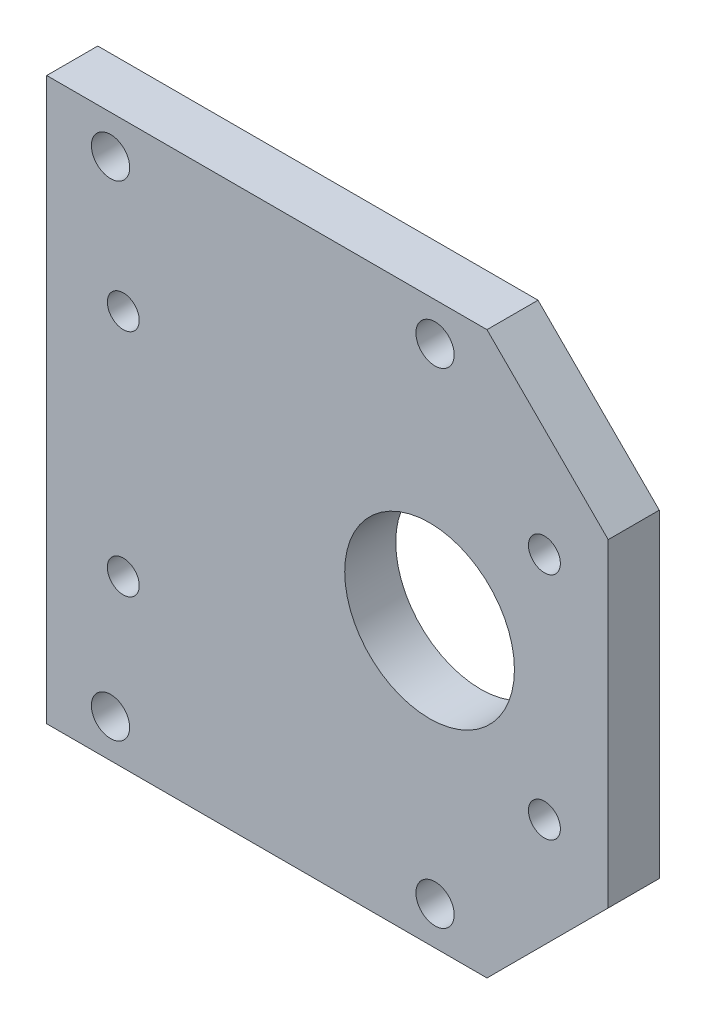
ISO-10303-21;
HEADER;
FILE_DESCRIPTION(('STEP AP214'),'2;1');
FILE_NAME('part.step','',(''),(''),'','','');
FILE_SCHEMA(('AUTOMOTIVE_DESIGN { 1 0 10303 214 1 1 1 1 }'));
ENDSEC;
DATA;
#1=APPLICATION_CONTEXT('core data for automotive mechanical design processes');
#2=APPLICATION_PROTOCOL_DEFINITION('international standard','automotive_design',2000,#1);
#3=PRODUCT_CONTEXT('',#1,'mechanical');
#4=PRODUCT('Part','Part','',(#3));
#5=PRODUCT_RELATED_PRODUCT_CATEGORY('part','',(#4));
#6=PRODUCT_DEFINITION_FORMATION('','',#4);
#7=PRODUCT_DEFINITION_CONTEXT('part definition',#1,'design');
#8=PRODUCT_DEFINITION('design','',#6,#7);
#9=PRODUCT_DEFINITION_SHAPE('','',#8);
#10=(LENGTH_UNIT() NAMED_UNIT(*) SI_UNIT(.MILLI.,.METRE.));
#11=(NAMED_UNIT(*) PLANE_ANGLE_UNIT() SI_UNIT($,.RADIAN.));
#12=(NAMED_UNIT(*) SI_UNIT($,.STERADIAN.) SOLID_ANGLE_UNIT());
#13=UNCERTAINTY_MEASURE_WITH_UNIT(LENGTH_MEASURE(1.E-05),#10,'distance_accuracy_value','');
#14=(GEOMETRIC_REPRESENTATION_CONTEXT(3) GLOBAL_UNCERTAINTY_ASSIGNED_CONTEXT((#13)) GLOBAL_UNIT_ASSIGNED_CONTEXT((#10,
#11,#12)) REPRESENTATION_CONTEXT('',''));
#15=CARTESIAN_POINT('',(0.,0.,0.));
#16=DIRECTION('',(0.,0.,1.));
#17=DIRECTION('',(1.,0.,0.));
#18=AXIS2_PLACEMENT_3D('',#15,#16,#17);
#19=CARTESIAN_POINT('',(0.,0.,4.));
#20=DIRECTION('',(0.,0.,-1.));
#21=DIRECTION('',(-1.,0.,0.));
#22=AXIS2_PLACEMENT_3D('',#19,#20,#21);
#23=PLANE('',#22);
#24=CARTESIAN_POINT('',(8.42893218813452,19.,4.));
#25=DIRECTION('',(0.,0.,1.));
#26=DIRECTION('',(-1.,0.,0.));
#27=AXIS2_PLACEMENT_3D('',#24,#25,#26);
#28=CIRCLE('',#27,1.5);
#29=CARTESIAN_POINT('',(6.92893218813451,19.,4.));
#30=VERTEX_POINT('',#29);
#31=EDGE_CURVE('E202',#30,#30,#28,.T.);
#32=ORIENTED_EDGE('',*,*,#31,.F.);
#33=EDGE_LOOP('',(#32));
#34=FACE_BOUND('',#33,.T.);
#35=CARTESIAN_POINT('',(-17.,19.,4.));
#36=DIRECTION('',(0.,0.,1.));
#37=DIRECTION('',(-1.,0.,0.));
#38=AXIS2_PLACEMENT_3D('',#35,#36,#37);
#39=CIRCLE('',#38,1.5);
#40=CARTESIAN_POINT('',(-18.5,19.,4.));
#41=VERTEX_POINT('',#40);
#42=EDGE_CURVE('E204',#41,#41,#39,.T.);
#43=ORIENTED_EDGE('',*,*,#42,.F.);
#44=EDGE_LOOP('',(#43));
#45=FACE_BOUND('',#44,.T.);
#46=CARTESIAN_POINT('',(8.42893218813452,-19.,4.));
#47=DIRECTION('',(0.,0.,1.));
#48=DIRECTION('',(1.,0.,0.));
#49=AXIS2_PLACEMENT_3D('',#46,#47,#48);
#50=CIRCLE('',#49,1.5);
#51=CARTESIAN_POINT('',(9.92893218813452,-19.,4.));
#52=VERTEX_POINT('',#51);
#53=EDGE_CURVE('E210',#52,#52,#50,.T.);
#54=ORIENTED_EDGE('',*,*,#53,.F.);
#55=EDGE_LOOP('',(#54));
#56=FACE_BOUND('',#55,.T.);
#57=CARTESIAN_POINT('',(-17.,-19.,4.));
#58=DIRECTION('',(0.,0.,1.));
#59=DIRECTION('',(1.,0.,0.));
#60=AXIS2_PLACEMENT_3D('',#57,#58,#59);
#61=CIRCLE('',#60,1.5);
#62=CARTESIAN_POINT('',(-15.5,-19.,4.));
#63=VERTEX_POINT('',#62);
#64=EDGE_CURVE('E216',#63,#63,#61,.T.);
#65=ORIENTED_EDGE('',*,*,#64,.F.);
#66=EDGE_LOOP('',(#65));
#67=FACE_BOUND('',#66,.T.);
#68=DIRECTION('',(-0.707106781186549,0.707106781186546,0.));
#69=VECTOR('',#68,1.);
#70=CARTESIAN_POINT('',(12.5,22.,4.));
#71=LINE('',#70,#69);
#72=CARTESIAN_POINT('',(22.,12.5,4.));
#73=VERTEX_POINT('',#72);
#74=CARTESIAN_POINT('',(12.5,22.,4.));
#75=VERTEX_POINT('',#74);
#76=EDGE_CURVE('E128',#73,#75,#71,.T.);
#77=ORIENTED_EDGE('',*,*,#76,.T.);
#78=DIRECTION('',(-1.,0.,0.));
#79=VECTOR('',#78,1.);
#80=CARTESIAN_POINT('',(-22.,22.,4.));
#81=LINE('',#80,#79);
#82=CARTESIAN_POINT('',(-22.,22.,4.));
#83=VERTEX_POINT('',#82);
#84=EDGE_CURVE('E86',#75,#83,#81,.T.);
#85=ORIENTED_EDGE('',*,*,#84,.T.);
#86=DIRECTION('',(0.,-1.,0.));
#87=VECTOR('',#86,1.);
#88=CARTESIAN_POINT('',(-22.,-22.,4.));
#89=LINE('',#88,#87);
#90=CARTESIAN_POINT('',(-22.,-22.,4.));
#91=VERTEX_POINT('',#90);
#92=EDGE_CURVE('E99',#83,#91,#89,.T.);
#93=ORIENTED_EDGE('',*,*,#92,.T.);
#94=DIRECTION('',(1.,0.,0.));
#95=VECTOR('',#94,1.);
#96=CARTESIAN_POINT('',(12.5,-22.,4.));
#97=LINE('',#96,#95);
#98=CARTESIAN_POINT('',(12.5,-22.,4.));
#99=VERTEX_POINT('',#98);
#100=EDGE_CURVE('E93',#91,#99,#97,.T.);
#101=ORIENTED_EDGE('',*,*,#100,.T.);
#102=DIRECTION('',(0.707106781186549,0.707106781186546,0.));
#103=VECTOR('',#102,1.);
#104=CARTESIAN_POINT('',(22.,-12.5,4.));
#105=LINE('',#104,#103);
#106=CARTESIAN_POINT('',(22.,-12.5,4.));
#107=VERTEX_POINT('',#106);
#108=EDGE_CURVE('E97',#99,#107,#105,.T.);
#109=ORIENTED_EDGE('',*,*,#108,.T.);
#110=DIRECTION('',(0.,1.,0.));
#111=VECTOR('',#110,1.);
#112=CARTESIAN_POINT('',(22.,12.5,4.));
#113=LINE('',#112,#111);
#114=EDGE_CURVE('E49',#107,#73,#113,.T.);
#115=ORIENTED_EDGE('',*,*,#114,.T.);
#116=EDGE_LOOP('',(#77,#85,#93,#101,#109,#115));
#117=FACE_BOUND('',#116,.T.);
#118=CARTESIAN_POINT('',(8.00000000000001,0.,4.));
#119=DIRECTION('',(0.,0.,1.));
#120=DIRECTION('',(1.,0.,0.));
#121=AXIS2_PLACEMENT_3D('',#118,#119,#120);
#122=CIRCLE('',#121,6.65);
#123=CARTESIAN_POINT('',(14.65,0.,4.));
#124=VERTEX_POINT('',#123);
#125=EDGE_CURVE('E121',#124,#124,#122,.T.);
#126=ORIENTED_EDGE('',*,*,#125,.F.);
#127=EDGE_LOOP('',(#126));
#128=FACE_BOUND('',#127,.T.);
#129=CARTESIAN_POINT('',(17.,9.,4.));
#130=DIRECTION('',(0.,0.,1.));
#131=DIRECTION('',(1.,0.,0.));
#132=AXIS2_PLACEMENT_3D('',#129,#130,#131);
#133=CIRCLE('',#132,1.25);
#134=CARTESIAN_POINT('',(18.25,9.,4.));
#135=VERTEX_POINT('',#134);
#136=EDGE_CURVE('E243',#135,#135,#133,.T.);
#137=ORIENTED_EDGE('',*,*,#136,.F.);
#138=EDGE_LOOP('',(#137));
#139=FACE_BOUND('',#138,.T.);
#140=CARTESIAN_POINT('',(17.,-9.,4.));
#141=DIRECTION('',(0.,0.,1.));
#142=DIRECTION('',(1.,0.,0.));
#143=AXIS2_PLACEMENT_3D('',#140,#141,#142);
#144=CIRCLE('',#143,1.25);
#145=CARTESIAN_POINT('',(18.25,-9.,4.));
#146=VERTEX_POINT('',#145);
#147=EDGE_CURVE('E237',#146,#146,#144,.T.);
#148=ORIENTED_EDGE('',*,*,#147,.F.);
#149=EDGE_LOOP('',(#148));
#150=FACE_BOUND('',#149,.T.);
#151=CARTESIAN_POINT('',(-16.,9.00000000000001,4.));
#152=DIRECTION('',(0.,0.,1.));
#153=DIRECTION('',(1.,0.,0.));
#154=AXIS2_PLACEMENT_3D('',#151,#152,#153);
#155=CIRCLE('',#154,1.25);
#156=CARTESIAN_POINT('',(-14.75,9.00000000000001,4.));
#157=VERTEX_POINT('',#156);
#158=EDGE_CURVE('E231',#157,#157,#155,.T.);
#159=ORIENTED_EDGE('',*,*,#158,.F.);
#160=EDGE_LOOP('',(#159));
#161=FACE_BOUND('',#160,.T.);
#162=CARTESIAN_POINT('',(-16.,-9.,4.));
#163=DIRECTION('',(0.,0.,1.));
#164=DIRECTION('',(1.,0.,0.));
#165=AXIS2_PLACEMENT_3D('',#162,#163,#164);
#166=CIRCLE('',#165,1.25);
#167=CARTESIAN_POINT('',(-14.75,-9.,4.));
#168=VERTEX_POINT('',#167);
#169=EDGE_CURVE('E225',#168,#168,#166,.T.);
#170=ORIENTED_EDGE('',*,*,#169,.F.);
#171=EDGE_LOOP('',(#170));
#172=FACE_BOUND('',#171,.T.);
#173=ADVANCED_FACE('F32',(#34,#45,#56,#67,#117,#128,#139,#150,#161,#172),#23,.F.);
#174=CARTESIAN_POINT('',(0.,0.,0.));
#175=DIRECTION('',(0.,0.,-1.));
#176=DIRECTION('',(-1.,0.,0.));
#177=AXIS2_PLACEMENT_3D('',#174,#175,#176);
#178=PLANE('',#177);
#179=CARTESIAN_POINT('',(8.42893218813452,19.,0.));
#180=DIRECTION('',(0.,0.,1.));
#181=DIRECTION('',(-1.,0.,0.));
#182=AXIS2_PLACEMENT_3D('',#179,#180,#181);
#183=CIRCLE('',#182,1.5);
#184=CARTESIAN_POINT('',(6.92893218813451,19.,0.));
#185=VERTEX_POINT('',#184);
#186=EDGE_CURVE('E200',#185,#185,#183,.T.);
#187=ORIENTED_EDGE('',*,*,#186,.T.);
#188=EDGE_LOOP('',(#187));
#189=FACE_BOUND('',#188,.T.);
#190=CARTESIAN_POINT('',(-17.,19.,0.));
#191=DIRECTION('',(0.,0.,1.));
#192=DIRECTION('',(-1.,0.,0.));
#193=AXIS2_PLACEMENT_3D('',#190,#191,#192);
#194=CIRCLE('',#193,1.5);
#195=CARTESIAN_POINT('',(-18.5,19.,0.));
#196=VERTEX_POINT('',#195);
#197=EDGE_CURVE('E207',#196,#196,#194,.T.);
#198=ORIENTED_EDGE('',*,*,#197,.T.);
#199=EDGE_LOOP('',(#198));
#200=FACE_BOUND('',#199,.T.);
#201=CARTESIAN_POINT('',(8.42893218813452,-19.,0.));
#202=DIRECTION('',(0.,0.,1.));
#203=DIRECTION('',(1.,0.,0.));
#204=AXIS2_PLACEMENT_3D('',#201,#202,#203);
#205=CIRCLE('',#204,1.5);
#206=CARTESIAN_POINT('',(9.92893218813452,-19.,0.));
#207=VERTEX_POINT('',#206);
#208=EDGE_CURVE('E213',#207,#207,#205,.T.);
#209=ORIENTED_EDGE('',*,*,#208,.T.);
#210=EDGE_LOOP('',(#209));
#211=FACE_BOUND('',#210,.T.);
#212=CARTESIAN_POINT('',(-17.,-19.,0.));
#213=DIRECTION('',(0.,0.,1.));
#214=DIRECTION('',(1.,0.,0.));
#215=AXIS2_PLACEMENT_3D('',#212,#213,#214);
#216=CIRCLE('',#215,1.5);
#217=CARTESIAN_POINT('',(-15.5,-19.,0.));
#218=VERTEX_POINT('',#217);
#219=EDGE_CURVE('E219',#218,#218,#216,.T.);
#220=ORIENTED_EDGE('',*,*,#219,.T.);
#221=EDGE_LOOP('',(#220));
#222=FACE_BOUND('',#221,.T.);
#223=CARTESIAN_POINT('',(-16.,9.00000000000001,0.));
#224=DIRECTION('',(0.,0.,1.));
#225=DIRECTION('',(1.,0.,0.));
#226=AXIS2_PLACEMENT_3D('',#223,#224,#225);
#227=CIRCLE('',#226,1.25);
#228=CARTESIAN_POINT('',(-14.75,9.00000000000001,0.));
#229=VERTEX_POINT('',#228);
#230=EDGE_CURVE('E228',#229,#229,#227,.T.);
#231=ORIENTED_EDGE('',*,*,#230,.T.);
#232=EDGE_LOOP('',(#231));
#233=FACE_BOUND('',#232,.T.);
#234=CARTESIAN_POINT('',(17.,9.,0.));
#235=DIRECTION('',(0.,0.,1.));
#236=DIRECTION('',(1.,0.,0.));
#237=AXIS2_PLACEMENT_3D('',#234,#235,#236);
#238=CIRCLE('',#237,1.25);
#239=CARTESIAN_POINT('',(18.25,9.,0.));
#240=VERTEX_POINT('',#239);
#241=EDGE_CURVE('E240',#240,#240,#238,.T.);
#242=ORIENTED_EDGE('',*,*,#241,.T.);
#243=EDGE_LOOP('',(#242));
#244=FACE_BOUND('',#243,.T.);
#245=DIRECTION('',(-0.707106781186549,0.707106781186546,0.));
#246=VECTOR('',#245,1.);
#247=CARTESIAN_POINT('',(12.5,22.,0.));
#248=LINE('',#247,#246);
#249=CARTESIAN_POINT('',(22.,12.5,0.));
#250=VERTEX_POINT('',#249);
#251=CARTESIAN_POINT('',(12.5,22.,0.));
#252=VERTEX_POINT('',#251);
#253=EDGE_CURVE('E117',#250,#252,#248,.T.);
#254=ORIENTED_EDGE('',*,*,#253,.F.);
#255=DIRECTION('',(0.,1.,0.));
#256=VECTOR('',#255,1.);
#257=CARTESIAN_POINT('',(22.,12.5,0.));
#258=LINE('',#257,#256);
#259=CARTESIAN_POINT('',(22.,-12.5,0.));
#260=VERTEX_POINT('',#259);
#261=EDGE_CURVE('E78',#260,#250,#258,.T.);
#262=ORIENTED_EDGE('',*,*,#261,.F.);
#263=DIRECTION('',(0.707106781186549,0.707106781186546,0.));
#264=VECTOR('',#263,1.);
#265=CARTESIAN_POINT('',(22.,-12.5,0.));
#266=LINE('',#265,#264);
#267=CARTESIAN_POINT('',(12.5,-22.,0.));
#268=VERTEX_POINT('',#267);
#269=EDGE_CURVE('E72',#268,#260,#266,.T.);
#270=ORIENTED_EDGE('',*,*,#269,.F.);
#271=DIRECTION('',(1.,0.,0.));
#272=VECTOR('',#271,1.);
#273=CARTESIAN_POINT('',(12.5,-22.,0.));
#274=LINE('',#273,#272);
#275=CARTESIAN_POINT('',(-22.,-22.,0.));
#276=VERTEX_POINT('',#275);
#277=EDGE_CURVE('E107',#276,#268,#274,.T.);
#278=ORIENTED_EDGE('',*,*,#277,.F.);
#279=DIRECTION('',(0.,-1.,0.));
#280=VECTOR('',#279,1.);
#281=CARTESIAN_POINT('',(-22.,-22.,0.));
#282=LINE('',#281,#280);
#283=CARTESIAN_POINT('',(-22.,22.,0.));
#284=VERTEX_POINT('',#283);
#285=EDGE_CURVE('E123',#284,#276,#282,.T.);
#286=ORIENTED_EDGE('',*,*,#285,.F.);
#287=DIRECTION('',(-1.,0.,0.));
#288=VECTOR('',#287,1.);
#289=CARTESIAN_POINT('',(-22.,22.,0.));
#290=LINE('',#289,#288);
#291=EDGE_CURVE('E120',#252,#284,#290,.T.);
#292=ORIENTED_EDGE('',*,*,#291,.F.);
#293=EDGE_LOOP('',(#254,#262,#270,#278,#286,#292));
#294=FACE_BOUND('',#293,.T.);
#295=CARTESIAN_POINT('',(8.00000000000001,0.,0.));
#296=DIRECTION('',(0.,0.,1.));
#297=DIRECTION('',(1.,0.,0.));
#298=AXIS2_PLACEMENT_3D('',#295,#296,#297);
#299=CIRCLE('',#298,6.65);
#300=CARTESIAN_POINT('',(14.65,0.,0.));
#301=VERTEX_POINT('',#300);
#302=EDGE_CURVE('E246',#301,#301,#299,.T.);
#303=ORIENTED_EDGE('',*,*,#302,.T.);
#304=EDGE_LOOP('',(#303));
#305=FACE_BOUND('',#304,.T.);
#306=CARTESIAN_POINT('',(17.,-9.,0.));
#307=DIRECTION('',(0.,0.,1.));
#308=DIRECTION('',(1.,0.,0.));
#309=AXIS2_PLACEMENT_3D('',#306,#307,#308);
#310=CIRCLE('',#309,1.25);
#311=CARTESIAN_POINT('',(18.25,-9.,0.));
#312=VERTEX_POINT('',#311);
#313=EDGE_CURVE('E234',#312,#312,#310,.T.);
#314=ORIENTED_EDGE('',*,*,#313,.T.);
#315=EDGE_LOOP('',(#314));
#316=FACE_BOUND('',#315,.T.);
#317=CARTESIAN_POINT('',(-16.,-9.,0.));
#318=DIRECTION('',(0.,0.,1.));
#319=DIRECTION('',(1.,0.,0.));
#320=AXIS2_PLACEMENT_3D('',#317,#318,#319);
#321=CIRCLE('',#320,1.25);
#322=CARTESIAN_POINT('',(-14.75,-9.,0.));
#323=VERTEX_POINT('',#322);
#324=EDGE_CURVE('E222',#323,#323,#321,.T.);
#325=ORIENTED_EDGE('',*,*,#324,.T.);
#326=EDGE_LOOP('',(#325));
#327=FACE_BOUND('',#326,.T.);
#328=ADVANCED_FACE('F137',(#189,#200,#211,#222,#233,#244,#294,#305,#316,#327),#178,.T.);
#329=CARTESIAN_POINT('',(12.5,22.,4.));
#330=DIRECTION('',(-0.707106781186546,-0.707106781186549,0.));
#331=DIRECTION('',(0.707106781186549,-0.707106781186546,0.));
#332=AXIS2_PLACEMENT_3D('',#329,#330,#331);
#333=PLANE('',#332);
#334=ORIENTED_EDGE('',*,*,#253,.T.);
#335=DIRECTION('',(0.,0.,-1.));
#336=VECTOR('',#335,1.);
#337=CARTESIAN_POINT('',(12.5,22.,4.));
#338=LINE('',#337,#336);
#339=EDGE_CURVE('E11',#75,#252,#338,.T.);
#340=ORIENTED_EDGE('',*,*,#339,.F.);
#341=ORIENTED_EDGE('',*,*,#76,.F.);
#342=DIRECTION('',(0.,0.,-1.));
#343=VECTOR('',#342,1.);
#344=CARTESIAN_POINT('',(22.,12.5,4.));
#345=LINE('',#344,#343);
#346=EDGE_CURVE('E113',#73,#250,#345,.T.);
#347=ORIENTED_EDGE('',*,*,#346,.T.);
#348=EDGE_LOOP('',(#334,#340,#341,#347));
#349=FACE_BOUND('',#348,.T.);
#350=ADVANCED_FACE('F34',(#349),#333,.F.);
#351=CARTESIAN_POINT('',(-22.,22.,4.));
#352=DIRECTION('',(0.,-1.,0.));
#353=DIRECTION('',(0.,0.,-1.));
#354=AXIS2_PLACEMENT_3D('',#351,#352,#353);
#355=PLANE('',#354);
#356=ORIENTED_EDGE('',*,*,#291,.T.);
#357=DIRECTION('',(0.,0.,-1.));
#358=VECTOR('',#357,1.);
#359=CARTESIAN_POINT('',(-22.,22.,4.));
#360=LINE('',#359,#358);
#361=EDGE_CURVE('E41',#83,#284,#360,.T.);
#362=ORIENTED_EDGE('',*,*,#361,.F.);
#363=ORIENTED_EDGE('',*,*,#84,.F.);
#364=ORIENTED_EDGE('',*,*,#339,.T.);
#365=EDGE_LOOP('',(#356,#362,#363,#364));
#366=FACE_BOUND('',#365,.T.);
#367=ADVANCED_FACE('F351',(#366),#355,.F.);
#368=CARTESIAN_POINT('',(-22.,-22.,4.));
#369=DIRECTION('',(1.,0.,0.));
#370=DIRECTION('',(0.,0.,-1.));
#371=AXIS2_PLACEMENT_3D('',#368,#369,#370);
#372=PLANE('',#371);
#373=ORIENTED_EDGE('',*,*,#285,.T.);
#374=DIRECTION('',(0.,0.,-1.));
#375=VECTOR('',#374,1.);
#376=CARTESIAN_POINT('',(-22.,-22.,4.));
#377=LINE('',#376,#375);
#378=EDGE_CURVE('E108',#91,#276,#377,.T.);
#379=ORIENTED_EDGE('',*,*,#378,.F.);
#380=ORIENTED_EDGE('',*,*,#92,.F.);
#381=ORIENTED_EDGE('',*,*,#361,.T.);
#382=EDGE_LOOP('',(#373,#379,#380,#381));
#383=FACE_BOUND('',#382,.T.);
#384=ADVANCED_FACE('F134',(#383),#372,.F.);
#385=CARTESIAN_POINT('',(12.5,-22.,4.));
#386=DIRECTION('',(0.,1.,0.));
#387=DIRECTION('',(-1.,0.,0.));
#388=AXIS2_PLACEMENT_3D('',#385,#386,#387);
#389=PLANE('',#388);
#390=ORIENTED_EDGE('',*,*,#277,.T.);
#391=DIRECTION('',(0.,0.,-1.));
#392=VECTOR('',#391,1.);
#393=CARTESIAN_POINT('',(12.5,-22.,4.));
#394=LINE('',#393,#392);
#395=EDGE_CURVE('E104',#99,#268,#394,.T.);
#396=ORIENTED_EDGE('',*,*,#395,.F.);
#397=ORIENTED_EDGE('',*,*,#100,.F.);
#398=ORIENTED_EDGE('',*,*,#378,.T.);
#399=EDGE_LOOP('',(#390,#396,#397,#398));
#400=FACE_BOUND('',#399,.T.);
#401=ADVANCED_FACE('F105',(#400),#389,.F.);
#402=CARTESIAN_POINT('',(22.,-12.5,4.));
#403=DIRECTION('',(-0.707106781186546,0.707106781186549,0.));
#404=DIRECTION('',(-0.707106781186549,-0.707106781186546,0.));
#405=AXIS2_PLACEMENT_3D('',#402,#403,#404);
#406=PLANE('',#405);
#407=ORIENTED_EDGE('',*,*,#269,.T.);
#408=DIRECTION('',(0.,0.,-1.));
#409=VECTOR('',#408,1.);
#410=CARTESIAN_POINT('',(22.,-12.5,4.));
#411=LINE('',#410,#409);
#412=EDGE_CURVE('E109',#107,#260,#411,.T.);
#413=ORIENTED_EDGE('',*,*,#412,.F.);
#414=ORIENTED_EDGE('',*,*,#108,.F.);
#415=ORIENTED_EDGE('',*,*,#395,.T.);
#416=EDGE_LOOP('',(#407,#413,#414,#415));
#417=FACE_BOUND('',#416,.T.);
#418=ADVANCED_FACE('F111',(#417),#406,.F.);
#419=CARTESIAN_POINT('',(22.,12.5,4.));
#420=DIRECTION('',(-1.,0.,0.));
#421=DIRECTION('',(0.,0.,1.));
#422=AXIS2_PLACEMENT_3D('',#419,#420,#421);
#423=PLANE('',#422);
#424=ORIENTED_EDGE('',*,*,#261,.T.);
#425=ORIENTED_EDGE('',*,*,#346,.F.);
#426=ORIENTED_EDGE('',*,*,#114,.F.);
#427=ORIENTED_EDGE('',*,*,#412,.T.);
#428=EDGE_LOOP('',(#424,#425,#426,#427));
#429=FACE_BOUND('',#428,.T.);
#430=ADVANCED_FACE('F142',(#429),#423,.F.);
#431=CARTESIAN_POINT('',(8.00000000000001,0.,4.));
#432=DIRECTION('',(0.,0.,-1.));
#433=DIRECTION('',(-1.,0.,0.));
#434=AXIS2_PLACEMENT_3D('',#431,#432,#433);
#435=CYLINDRICAL_SURFACE('',#434,6.65);
#436=ORIENTED_EDGE('',*,*,#125,.T.);
#437=EDGE_LOOP('',(#436));
#438=FACE_BOUND('',#437,.T.);
#439=ORIENTED_EDGE('',*,*,#302,.F.);
#440=EDGE_LOOP('',(#439));
#441=FACE_BOUND('',#440,.T.);
#442=ADVANCED_FACE('F144',(#438,#441),#435,.F.);
#443=CARTESIAN_POINT('',(17.,9.,4.));
#444=DIRECTION('',(0.,0.,-1.));
#445=DIRECTION('',(-1.,0.,0.));
#446=AXIS2_PLACEMENT_3D('',#443,#444,#445);
#447=CYLINDRICAL_SURFACE('',#446,1.25);
#448=ORIENTED_EDGE('',*,*,#136,.T.);
#449=EDGE_LOOP('',(#448));
#450=FACE_BOUND('',#449,.T.);
#451=ORIENTED_EDGE('',*,*,#241,.F.);
#452=EDGE_LOOP('',(#451));
#453=FACE_BOUND('',#452,.T.);
#454=ADVANCED_FACE('F150',(#450,#453),#447,.F.);
#455=CARTESIAN_POINT('',(17.,-9.,4.));
#456=DIRECTION('',(0.,0.,-1.));
#457=DIRECTION('',(-1.,0.,0.));
#458=AXIS2_PLACEMENT_3D('',#455,#456,#457);
#459=CYLINDRICAL_SURFACE('',#458,1.25);
#460=ORIENTED_EDGE('',*,*,#147,.T.);
#461=EDGE_LOOP('',(#460));
#462=FACE_BOUND('',#461,.T.);
#463=ORIENTED_EDGE('',*,*,#313,.F.);
#464=EDGE_LOOP('',(#463));
#465=FACE_BOUND('',#464,.T.);
#466=ADVANCED_FACE('F167',(#462,#465),#459,.F.);
#467=CARTESIAN_POINT('',(-16.,9.00000000000001,4.));
#468=DIRECTION('',(0.,0.,-1.));
#469=DIRECTION('',(-1.,0.,0.));
#470=AXIS2_PLACEMENT_3D('',#467,#468,#469);
#471=CYLINDRICAL_SURFACE('',#470,1.25);
#472=ORIENTED_EDGE('',*,*,#158,.T.);
#473=EDGE_LOOP('',(#472));
#474=FACE_BOUND('',#473,.T.);
#475=ORIENTED_EDGE('',*,*,#230,.F.);
#476=EDGE_LOOP('',(#475));
#477=FACE_BOUND('',#476,.T.);
#478=ADVANCED_FACE('F171',(#474,#477),#471,.F.);
#479=CARTESIAN_POINT('',(-16.,-9.,4.));
#480=DIRECTION('',(0.,0.,-1.));
#481=DIRECTION('',(-1.,0.,0.));
#482=AXIS2_PLACEMENT_3D('',#479,#480,#481);
#483=CYLINDRICAL_SURFACE('',#482,1.25);
#484=ORIENTED_EDGE('',*,*,#169,.T.);
#485=EDGE_LOOP('',(#484));
#486=FACE_BOUND('',#485,.T.);
#487=ORIENTED_EDGE('',*,*,#324,.F.);
#488=EDGE_LOOP('',(#487));
#489=FACE_BOUND('',#488,.T.);
#490=ADVANCED_FACE('F175',(#486,#489),#483,.F.);
#491=CARTESIAN_POINT('',(-17.,-19.,0.));
#492=DIRECTION('',(0.,0.,1.));
#493=DIRECTION('',(1.,0.,0.));
#494=AXIS2_PLACEMENT_3D('',#491,#492,#493);
#495=CYLINDRICAL_SURFACE('',#494,1.5);
#496=ORIENTED_EDGE('',*,*,#219,.F.);
#497=EDGE_LOOP('',(#496));
#498=FACE_BOUND('',#497,.T.);
#499=ORIENTED_EDGE('',*,*,#64,.T.);
#500=EDGE_LOOP('',(#499));
#501=FACE_BOUND('',#500,.T.);
#502=ADVANCED_FACE('F179',(#498,#501),#495,.F.);
#503=CARTESIAN_POINT('',(8.42893218813452,-19.,0.));
#504=DIRECTION('',(0.,0.,1.));
#505=DIRECTION('',(1.,0.,0.));
#506=AXIS2_PLACEMENT_3D('',#503,#504,#505);
#507=CYLINDRICAL_SURFACE('',#506,1.5);
#508=ORIENTED_EDGE('',*,*,#208,.F.);
#509=EDGE_LOOP('',(#508));
#510=FACE_BOUND('',#509,.T.);
#511=ORIENTED_EDGE('',*,*,#53,.T.);
#512=EDGE_LOOP('',(#511));
#513=FACE_BOUND('',#512,.T.);
#514=ADVANCED_FACE('F183',(#510,#513),#507,.F.);
#515=CARTESIAN_POINT('',(-17.,19.,0.));
#516=DIRECTION('',(0.,0.,1.));
#517=DIRECTION('',(1.,0.,0.));
#518=AXIS2_PLACEMENT_3D('',#515,#516,#517);
#519=CYLINDRICAL_SURFACE('',#518,1.5);
#520=ORIENTED_EDGE('',*,*,#197,.F.);
#521=EDGE_LOOP('',(#520));
#522=FACE_BOUND('',#521,.T.);
#523=ORIENTED_EDGE('',*,*,#42,.T.);
#524=EDGE_LOOP('',(#523));
#525=FACE_BOUND('',#524,.T.);
#526=ADVANCED_FACE('F187',(#522,#525),#519,.F.);
#527=CARTESIAN_POINT('',(8.42893218813452,19.,0.));
#528=DIRECTION('',(0.,0.,1.));
#529=DIRECTION('',(1.,0.,0.));
#530=AXIS2_PLACEMENT_3D('',#527,#528,#529);
#531=CYLINDRICAL_SURFACE('',#530,1.5);
#532=ORIENTED_EDGE('',*,*,#186,.F.);
#533=EDGE_LOOP('',(#532));
#534=FACE_BOUND('',#533,.T.);
#535=ORIENTED_EDGE('',*,*,#31,.T.);
#536=EDGE_LOOP('',(#535));
#537=FACE_BOUND('',#536,.T.);
#538=ADVANCED_FACE('F191',(#534,#537),#531,.F.);
#539=CLOSED_SHELL('',(#173,#328,#350,#367,#384,#401,#418,#430,#442,#454,#466,#478,#490,#502,
#514,#526,#538));
#540=MANIFOLD_SOLID_BREP('B2',#539);
#541=ADVANCED_BREP_SHAPE_REPRESENTATION('',(#18,#540),#14);
#542=SHAPE_DEFINITION_REPRESENTATION(#9,#541);
ENDSEC;
END-ISO-10303-21;
